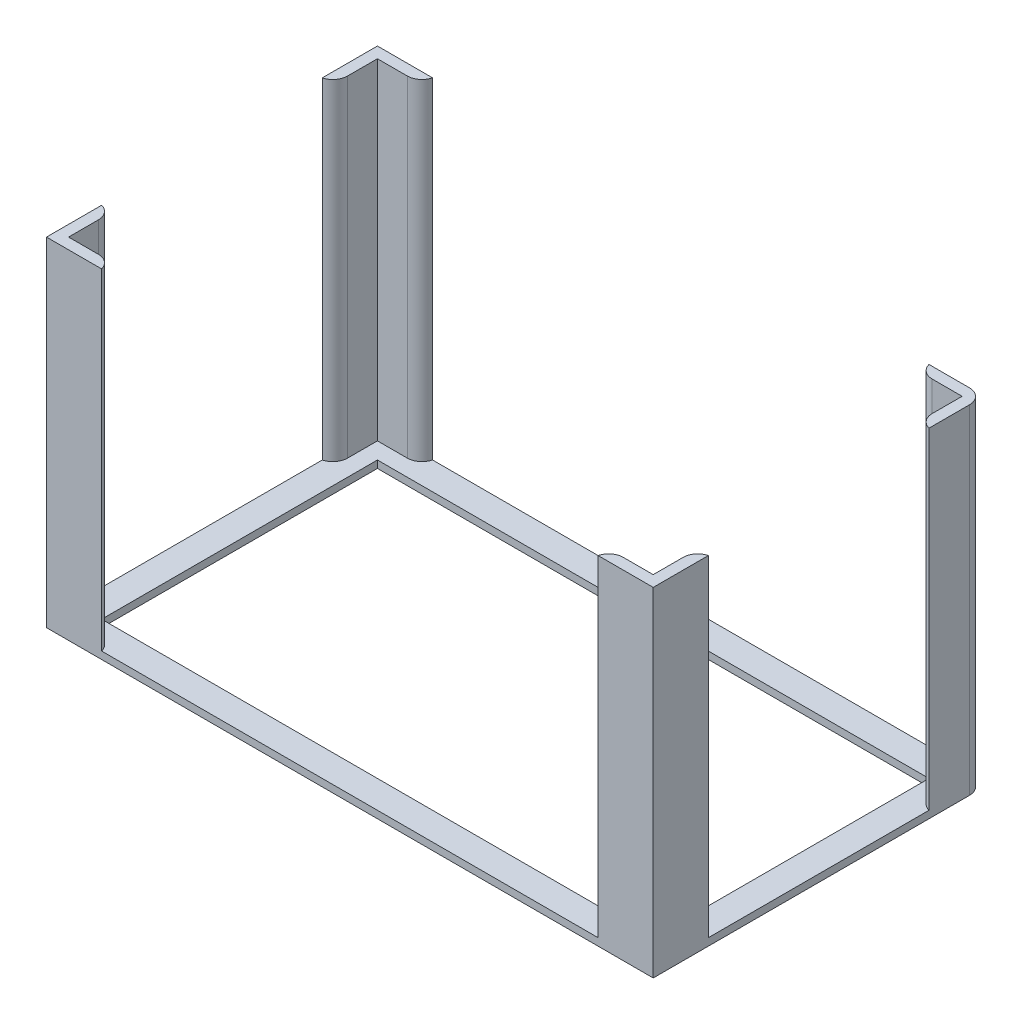
ISO-10303-21;
HEADER;
FILE_DESCRIPTION(('STEP AP214'),'2;1');
FILE_NAME('part.step','',(''),(''),'','','');
FILE_SCHEMA(('AUTOMOTIVE_DESIGN { 1 0 10303 214 1 1 1 1 }'));
ENDSEC;
DATA;
#1=APPLICATION_CONTEXT('core data for automotive mechanical design processes');
#2=APPLICATION_PROTOCOL_DEFINITION('international standard','automotive_design',2000,#1);
#3=PRODUCT_CONTEXT('',#1,'mechanical');
#4=PRODUCT('Part','Part','',(#3));
#5=PRODUCT_RELATED_PRODUCT_CATEGORY('part','',(#4));
#6=PRODUCT_DEFINITION_FORMATION('','',#4);
#7=PRODUCT_DEFINITION_CONTEXT('part definition',#1,'design');
#8=PRODUCT_DEFINITION('design','',#6,#7);
#9=PRODUCT_DEFINITION_SHAPE('','',#8);
#10=(LENGTH_UNIT() NAMED_UNIT(*) SI_UNIT(.MILLI.,.METRE.));
#11=(NAMED_UNIT(*) PLANE_ANGLE_UNIT() SI_UNIT($,.RADIAN.));
#12=(NAMED_UNIT(*) SI_UNIT($,.STERADIAN.) SOLID_ANGLE_UNIT());
#13=UNCERTAINTY_MEASURE_WITH_UNIT(LENGTH_MEASURE(1.E-05),#10,'distance_accuracy_value','');
#14=(GEOMETRIC_REPRESENTATION_CONTEXT(3) GLOBAL_UNCERTAINTY_ASSIGNED_CONTEXT((#13)) GLOBAL_UNIT_ASSIGNED_CONTEXT((#10,
#11,#12)) REPRESENTATION_CONTEXT('',''));
#15=CARTESIAN_POINT('',(0.,0.,0.));
#16=DIRECTION('',(0.,0.,1.));
#17=DIRECTION('',(1.,0.,0.));
#18=AXIS2_PLACEMENT_3D('',#15,#16,#17);
#19=CARTESIAN_POINT('',(0.,2.,0.));
#20=DIRECTION('',(0.,1.,0.));
#21=DIRECTION('',(0.,0.,1.));
#22=AXIS2_PLACEMENT_3D('',#19,#20,#21);
#23=PLANE('',#22);
#24=DIRECTION('',(-1.,0.,0.));
#25=VECTOR('',#24,1.);
#26=CARTESIAN_POINT('',(-75.,2.,-37.5));
#27=LINE('',#26,#25);
#28=CARTESIAN_POINT('',(75.,2.,-37.5));
#29=VERTEX_POINT('',#28);
#30=CARTESIAN_POINT('',(-75.,2.,-37.5));
#31=VERTEX_POINT('',#30);
#32=EDGE_CURVE('E333',#29,#31,#27,.T.);
#33=ORIENTED_EDGE('',*,*,#32,.F.);
#34=DIRECTION('',(0.,0.,-1.));
#35=VECTOR('',#34,1.);
#36=CARTESIAN_POINT('',(75.,2.,-37.5));
#37=LINE('',#36,#35);
#38=CARTESIAN_POINT('',(75.,2.,37.5));
#39=VERTEX_POINT('',#38);
#40=EDGE_CURVE('E331',#39,#29,#37,.T.);
#41=ORIENTED_EDGE('',*,*,#40,.F.);
#42=DIRECTION('',(1.,0.,0.));
#43=VECTOR('',#42,1.);
#44=CARTESIAN_POINT('',(-75.,2.,37.5));
#45=LINE('',#44,#43);
#46=CARTESIAN_POINT('',(-75.,2.,37.5));
#47=VERTEX_POINT('',#46);
#48=EDGE_CURVE('E339',#47,#39,#45,.T.);
#49=ORIENTED_EDGE('',*,*,#48,.F.);
#50=DIRECTION('',(0.,0.,1.));
#51=VECTOR('',#50,1.);
#52=CARTESIAN_POINT('',(-75.,2.,-37.5));
#53=LINE('',#52,#51);
#54=EDGE_CURVE('E336',#31,#47,#53,.T.);
#55=ORIENTED_EDGE('',*,*,#54,.F.);
#56=EDGE_LOOP('',(#33,#41,#49,#55));
#57=FACE_BOUND('',#56,.T.);
#58=DIRECTION('',(-1.,0.,0.));
#59=VECTOR('',#58,1.);
#60=CARTESIAN_POINT('',(-67.5,2.,42.));
#61=LINE('',#60,#59);
#62=CARTESIAN_POINT('',(-71.3729833462074,2.,42.));
#63=VERTEX_POINT('',#62);
#64=CARTESIAN_POINT('',(-79.5,2.,42.));
#65=VERTEX_POINT('',#64);
#66=EDGE_CURVE('E238',#63,#65,#61,.T.);
#67=ORIENTED_EDGE('',*,*,#66,.F.);
#68=CARTESIAN_POINT('',(-71.3729833462074,2.,46.));
#69=DIRECTION('',(0.,1.,0.));
#70=DIRECTION('',(0.,0.,1.));
#71=AXIS2_PLACEMENT_3D('',#68,#69,#70);
#72=CIRCLE('',#71,4.);
#73=CARTESIAN_POINT('',(-67.5,2.,45.));
#74=VERTEX_POINT('',#73);
#75=EDGE_CURVE('E40',#63,#74,#72,.F.);
#76=ORIENTED_EDGE('',*,*,#75,.T.);
#77=DIRECTION('',(1.,0.,0.));
#78=VECTOR('',#77,1.);
#79=CARTESIAN_POINT('',(-82.5,2.,45.));
#80=LINE('',#79,#78);
#81=CARTESIAN_POINT('',(67.5,2.,45.));
#82=VERTEX_POINT('',#81);
#83=EDGE_CURVE('E370',#74,#82,#80,.T.);
#84=ORIENTED_EDGE('',*,*,#83,.T.);
#85=CARTESIAN_POINT('',(71.3729833462074,2.,46.));
#86=DIRECTION('',(0.,1.,0.));
#87=DIRECTION('',(0.,0.,1.));
#88=AXIS2_PLACEMENT_3D('',#85,#86,#87);
#89=CIRCLE('',#88,4.);
#90=CARTESIAN_POINT('',(71.3729833462074,2.,42.));
#91=VERTEX_POINT('',#90);
#92=EDGE_CURVE('E432',#82,#91,#89,.F.);
#93=ORIENTED_EDGE('',*,*,#92,.T.);
#94=DIRECTION('',(1.,0.,0.));
#95=VECTOR('',#94,1.);
#96=CARTESIAN_POINT('',(67.5,2.,42.));
#97=LINE('',#96,#95);
#98=CARTESIAN_POINT('',(79.5,2.,42.));
#99=VERTEX_POINT('',#98);
#100=EDGE_CURVE('E261',#91,#99,#97,.T.);
#101=ORIENTED_EDGE('',*,*,#100,.T.);
#102=DIRECTION('',(0.,0.,-1.));
#103=VECTOR('',#102,1.);
#104=CARTESIAN_POINT('',(79.5,2.,42.));
#105=LINE('',#104,#103);
#106=CARTESIAN_POINT('',(79.5,2.,33.8729833462074));
#107=VERTEX_POINT('',#106);
#108=EDGE_CURVE('E239',#99,#107,#105,.T.);
#109=ORIENTED_EDGE('',*,*,#108,.T.);
#110=CARTESIAN_POINT('',(83.5,2.,33.8729833462074));
#111=DIRECTION('',(0.,1.,0.));
#112=DIRECTION('',(0.,0.,1.));
#113=AXIS2_PLACEMENT_3D('',#110,#111,#112);
#114=CIRCLE('',#113,4.);
#115=CARTESIAN_POINT('',(82.5,2.,30.));
#116=VERTEX_POINT('',#115);
#117=EDGE_CURVE('E434',#107,#116,#114,.F.);
#118=ORIENTED_EDGE('',*,*,#117,.T.);
#119=DIRECTION('',(0.,0.,-1.));
#120=VECTOR('',#119,1.);
#121=CARTESIAN_POINT('',(82.5,2.,-45.));
#122=LINE('',#121,#120);
#123=CARTESIAN_POINT('',(82.5,2.,-30.));
#124=VERTEX_POINT('',#123);
#125=EDGE_CURVE('E362',#116,#124,#122,.T.);
#126=ORIENTED_EDGE('',*,*,#125,.T.);
#127=CARTESIAN_POINT('',(83.5,2.,-33.8729833462074));
#128=DIRECTION('',(0.,1.,0.));
#129=DIRECTION('',(0.,0.,1.));
#130=AXIS2_PLACEMENT_3D('',#127,#128,#129);
#131=CIRCLE('',#130,4.);
#132=CARTESIAN_POINT('',(79.5,2.,-33.8729833462074));
#133=VERTEX_POINT('',#132);
#134=EDGE_CURVE('E408',#124,#133,#131,.F.);
#135=ORIENTED_EDGE('',*,*,#134,.T.);
#136=DIRECTION('',(0.,0.,1.));
#137=VECTOR('',#136,1.);
#138=CARTESIAN_POINT('',(79.5,2.,-42.));
#139=LINE('',#138,#137);
#140=CARTESIAN_POINT('',(79.5,2.,-42.));
#141=VERTEX_POINT('',#140);
#142=EDGE_CURVE('E310',#141,#133,#139,.T.);
#143=ORIENTED_EDGE('',*,*,#142,.F.);
#144=DIRECTION('',(1.,0.,0.));
#145=VECTOR('',#144,1.);
#146=CARTESIAN_POINT('',(67.5,2.,-42.));
#147=LINE('',#146,#145);
#148=CARTESIAN_POINT('',(71.3729833462074,2.,-42.));
#149=VERTEX_POINT('',#148);
#150=EDGE_CURVE('E306',#149,#141,#147,.T.);
#151=ORIENTED_EDGE('',*,*,#150,.F.);
#152=CARTESIAN_POINT('',(71.3729833462074,2.,-46.));
#153=DIRECTION('',(0.,1.,0.));
#154=DIRECTION('',(0.,0.,1.));
#155=AXIS2_PLACEMENT_3D('',#152,#153,#154);
#156=CIRCLE('',#155,4.);
#157=CARTESIAN_POINT('',(67.5,2.,-45.));
#158=VERTEX_POINT('',#157);
#159=EDGE_CURVE('E406',#149,#158,#156,.F.);
#160=ORIENTED_EDGE('',*,*,#159,.T.);
#161=DIRECTION('',(-1.,0.,0.));
#162=VECTOR('',#161,1.);
#163=CARTESIAN_POINT('',(-82.5,2.,-45.));
#164=LINE('',#163,#162);
#165=CARTESIAN_POINT('',(-67.5,2.,-45.));
#166=VERTEX_POINT('',#165);
#167=EDGE_CURVE('E364',#158,#166,#164,.T.);
#168=ORIENTED_EDGE('',*,*,#167,.T.);
#169=CARTESIAN_POINT('',(-71.3729833462074,2.,-46.));
#170=DIRECTION('',(0.,1.,0.));
#171=DIRECTION('',(0.,0.,1.));
#172=AXIS2_PLACEMENT_3D('',#169,#170,#171);
#173=CIRCLE('',#172,4.);
#174=CARTESIAN_POINT('',(-71.3729833462074,2.,-42.));
#175=VERTEX_POINT('',#174);
#176=EDGE_CURVE('E419',#166,#175,#173,.F.);
#177=ORIENTED_EDGE('',*,*,#176,.T.);
#178=DIRECTION('',(-1.,0.,0.));
#179=VECTOR('',#178,1.);
#180=CARTESIAN_POINT('',(-67.5,2.,-42.));
#181=LINE('',#180,#179);
#182=CARTESIAN_POINT('',(-79.5,2.,-42.));
#183=VERTEX_POINT('',#182);
#184=EDGE_CURVE('E286',#175,#183,#181,.T.);
#185=ORIENTED_EDGE('',*,*,#184,.T.);
#186=DIRECTION('',(0.,0.,1.));
#187=VECTOR('',#186,1.);
#188=CARTESIAN_POINT('',(-79.5,2.,-42.));
#189=LINE('',#188,#187);
#190=CARTESIAN_POINT('',(-79.5,2.,-33.8729833462074));
#191=VERTEX_POINT('',#190);
#192=EDGE_CURVE('E281',#183,#191,#189,.T.);
#193=ORIENTED_EDGE('',*,*,#192,.T.);
#194=CARTESIAN_POINT('',(-83.5,2.,-33.8729833462074));
#195=DIRECTION('',(0.,1.,0.));
#196=DIRECTION('',(0.,0.,1.));
#197=AXIS2_PLACEMENT_3D('',#194,#195,#196);
#198=CIRCLE('',#197,4.);
#199=CARTESIAN_POINT('',(-82.5,2.,-30.));
#200=VERTEX_POINT('',#199);
#201=EDGE_CURVE('E421',#191,#200,#198,.F.);
#202=ORIENTED_EDGE('',*,*,#201,.T.);
#203=DIRECTION('',(0.,0.,1.));
#204=VECTOR('',#203,1.);
#205=CARTESIAN_POINT('',(-82.5,2.,-45.));
#206=LINE('',#205,#204);
#207=CARTESIAN_POINT('',(-82.5,2.,30.));
#208=VERTEX_POINT('',#207);
#209=EDGE_CURVE('E368',#200,#208,#206,.T.);
#210=ORIENTED_EDGE('',*,*,#209,.T.);
#211=CARTESIAN_POINT('',(-83.5,2.,33.8729833462074));
#212=DIRECTION('',(0.,1.,0.));
#213=DIRECTION('',(0.,0.,1.));
#214=AXIS2_PLACEMENT_3D('',#211,#212,#213);
#215=CIRCLE('',#214,4.);
#216=CARTESIAN_POINT('',(-79.5,2.,33.8729833462074));
#217=VERTEX_POINT('',#216);
#218=EDGE_CURVE('E11',#208,#217,#215,.F.);
#219=ORIENTED_EDGE('',*,*,#218,.T.);
#220=DIRECTION('',(0.,0.,-1.));
#221=VECTOR('',#220,1.);
#222=CARTESIAN_POINT('',(-79.5,2.,42.));
#223=LINE('',#222,#221);
#224=EDGE_CURVE('E232',#65,#217,#223,.T.);
#225=ORIENTED_EDGE('',*,*,#224,.F.);
#226=EDGE_LOOP('',(#67,#76,#84,#93,#101,#109,#118,#126,#135,#143,#151,#160,#168,#177,#185,#193,
#202,#210,#219,#225));
#227=FACE_BOUND('',#226,.T.);
#228=ADVANCED_FACE('F32',(#57,#227),#23,.T.);
#229=CARTESIAN_POINT('',(0.,0.,0.));
#230=DIRECTION('',(0.,1.,0.));
#231=DIRECTION('',(0.,0.,1.));
#232=AXIS2_PLACEMENT_3D('',#229,#230,#231);
#233=PLANE('',#232);
#234=DIRECTION('',(-1.,0.,0.));
#235=VECTOR('',#234,1.);
#236=CARTESIAN_POINT('',(-82.5,0.,-45.));
#237=LINE('',#236,#235);
#238=CARTESIAN_POINT('',(78.5,0.,-45.));
#239=VERTEX_POINT('',#238);
#240=CARTESIAN_POINT('',(-82.5,0.,-45.));
#241=VERTEX_POINT('',#240);
#242=EDGE_CURVE('E375',#239,#241,#237,.T.);
#243=ORIENTED_EDGE('',*,*,#242,.F.);
#244=CARTESIAN_POINT('',(78.5,0.,-41.));
#245=DIRECTION('',(0.,1.,0.));
#246=DIRECTION('',(0.,0.,1.));
#247=AXIS2_PLACEMENT_3D('',#244,#245,#246);
#248=CIRCLE('',#247,4.);
#249=CARTESIAN_POINT('',(82.5,0.,-41.));
#250=VERTEX_POINT('',#249);
#251=EDGE_CURVE('E391',#239,#250,#248,.F.);
#252=ORIENTED_EDGE('',*,*,#251,.T.);
#253=DIRECTION('',(0.,0.,-1.));
#254=VECTOR('',#253,1.);
#255=CARTESIAN_POINT('',(82.5,0.,-45.));
#256=LINE('',#255,#254);
#257=CARTESIAN_POINT('',(82.5,0.,45.));
#258=VERTEX_POINT('',#257);
#259=EDGE_CURVE('E361',#258,#250,#256,.T.);
#260=ORIENTED_EDGE('',*,*,#259,.F.);
#261=DIRECTION('',(1.,0.,0.));
#262=VECTOR('',#261,1.);
#263=CARTESIAN_POINT('',(-82.5,0.,45.));
#264=LINE('',#263,#262);
#265=CARTESIAN_POINT('',(-82.5,0.,45.));
#266=VERTEX_POINT('',#265);
#267=EDGE_CURVE('E365',#266,#258,#264,.T.);
#268=ORIENTED_EDGE('',*,*,#267,.F.);
#269=DIRECTION('',(0.,0.,1.));
#270=VECTOR('',#269,1.);
#271=CARTESIAN_POINT('',(-82.5,0.,-45.));
#272=LINE('',#271,#270);
#273=EDGE_CURVE('E377',#241,#266,#272,.T.);
#274=ORIENTED_EDGE('',*,*,#273,.F.);
#275=EDGE_LOOP('',(#243,#252,#260,#268,#274));
#276=FACE_BOUND('',#275,.T.);
#277=DIRECTION('',(0.,0.,-1.));
#278=VECTOR('',#277,1.);
#279=CARTESIAN_POINT('',(75.,0.,-37.5));
#280=LINE('',#279,#278);
#281=CARTESIAN_POINT('',(75.,0.,37.5));
#282=VERTEX_POINT('',#281);
#283=CARTESIAN_POINT('',(75.,0.,-37.5));
#284=VERTEX_POINT('',#283);
#285=EDGE_CURVE('E330',#282,#284,#280,.T.);
#286=ORIENTED_EDGE('',*,*,#285,.T.);
#287=DIRECTION('',(-1.,0.,0.));
#288=VECTOR('',#287,1.);
#289=CARTESIAN_POINT('',(-75.,0.,-37.5));
#290=LINE('',#289,#288);
#291=CARTESIAN_POINT('',(-75.,0.,-37.5));
#292=VERTEX_POINT('',#291);
#293=EDGE_CURVE('E344',#284,#292,#290,.T.);
#294=ORIENTED_EDGE('',*,*,#293,.T.);
#295=DIRECTION('',(0.,0.,1.));
#296=VECTOR('',#295,1.);
#297=CARTESIAN_POINT('',(-75.,0.,-37.5));
#298=LINE('',#297,#296);
#299=CARTESIAN_POINT('',(-75.,0.,37.5));
#300=VERTEX_POINT('',#299);
#301=EDGE_CURVE('E347',#292,#300,#298,.T.);
#302=ORIENTED_EDGE('',*,*,#301,.T.);
#303=DIRECTION('',(1.,0.,0.));
#304=VECTOR('',#303,1.);
#305=CARTESIAN_POINT('',(-75.,0.,37.5));
#306=LINE('',#305,#304);
#307=EDGE_CURVE('E334',#300,#282,#306,.T.);
#308=ORIENTED_EDGE('',*,*,#307,.T.);
#309=EDGE_LOOP('',(#286,#294,#302,#308));
#310=FACE_BOUND('',#309,.T.);
#311=ADVANCED_FACE('F459',(#276,#310),#233,.F.);
#312=CARTESIAN_POINT('',(82.5,2.,-45.));
#313=DIRECTION('',(-1.,0.,0.));
#314=DIRECTION('',(0.,0.,1.));
#315=AXIS2_PLACEMENT_3D('',#312,#313,#314);
#316=PLANE('',#315);
#317=ORIENTED_EDGE('',*,*,#259,.T.);
#318=DIRECTION('',(0.,-1.,0.));
#319=VECTOR('',#318,1.);
#320=CARTESIAN_POINT('',(82.5,2.,-41.));
#321=LINE('',#320,#319);
#322=CARTESIAN_POINT('',(82.5,92.,-41.));
#323=VERTEX_POINT('',#322);
#324=EDGE_CURVE('E393',#250,#323,#321,.F.);
#325=ORIENTED_EDGE('',*,*,#324,.T.);
#326=DIRECTION('',(0.,0.,-1.));
#327=VECTOR('',#326,1.);
#328=CARTESIAN_POINT('',(82.5,92.,-30.));
#329=LINE('',#328,#327);
#330=CARTESIAN_POINT('',(82.5,92.,-30.));
#331=VERTEX_POINT('',#330);
#332=EDGE_CURVE('E313',#331,#323,#329,.T.);
#333=ORIENTED_EDGE('',*,*,#332,.F.);
#334=DIRECTION('',(0.,-1.,0.));
#335=VECTOR('',#334,1.);
#336=CARTESIAN_POINT('',(82.5,92.,-30.));
#337=LINE('',#336,#335);
#338=EDGE_CURVE('E324',#331,#124,#337,.T.);
#339=ORIENTED_EDGE('',*,*,#338,.T.);
#340=ORIENTED_EDGE('',*,*,#125,.F.);
#341=DIRECTION('',(0.,-1.,0.));
#342=VECTOR('',#341,1.);
#343=CARTESIAN_POINT('',(82.5,92.,30.));
#344=LINE('',#343,#342);
#345=CARTESIAN_POINT('',(82.5,92.,30.));
#346=VERTEX_POINT('',#345);
#347=EDGE_CURVE('E275',#346,#116,#344,.T.);
#348=ORIENTED_EDGE('',*,*,#347,.F.);
#349=DIRECTION('',(0.,0.,1.));
#350=VECTOR('',#349,1.);
#351=CARTESIAN_POINT('',(82.5,92.,30.));
#352=LINE('',#351,#350);
#353=CARTESIAN_POINT('',(82.5,92.,45.));
#354=VERTEX_POINT('',#353);
#355=EDGE_CURVE('E260',#346,#354,#352,.T.);
#356=ORIENTED_EDGE('',*,*,#355,.T.);
#357=DIRECTION('',(0.,-1.,0.));
#358=VECTOR('',#357,1.);
#359=CARTESIAN_POINT('',(82.5,2.,45.));
#360=LINE('',#359,#358);
#361=EDGE_CURVE('E372',#354,#258,#360,.T.);
#362=ORIENTED_EDGE('',*,*,#361,.T.);
#363=EDGE_LOOP('',(#317,#325,#333,#339,#340,#348,#356,#362));
#364=FACE_BOUND('',#363,.T.);
#365=ADVANCED_FACE('F465',(#364),#316,.F.);
#366=CARTESIAN_POINT('',(-82.5,2.,-45.));
#367=DIRECTION('',(0.,0.,1.));
#368=DIRECTION('',(1.,0.,0.));
#369=AXIS2_PLACEMENT_3D('',#366,#367,#368);
#370=PLANE('',#369);
#371=DIRECTION('',(-1.,0.,0.));
#372=VECTOR('',#371,1.);
#373=CARTESIAN_POINT('',(82.5,92.,-45.));
#374=LINE('',#373,#372);
#375=CARTESIAN_POINT('',(78.5,92.,-45.));
#376=VERTEX_POINT('',#375);
#377=CARTESIAN_POINT('',(67.5,92.,-45.));
#378=VERTEX_POINT('',#377);
#379=EDGE_CURVE('E316',#376,#378,#374,.T.);
#380=ORIENTED_EDGE('',*,*,#379,.F.);
#381=DIRECTION('',(0.,-1.,0.));
#382=VECTOR('',#381,1.);
#383=CARTESIAN_POINT('',(78.5,2.,-45.));
#384=LINE('',#383,#382);
#385=EDGE_CURVE('E388',#376,#239,#384,.T.);
#386=ORIENTED_EDGE('',*,*,#385,.T.);
#387=ORIENTED_EDGE('',*,*,#242,.T.);
#388=DIRECTION('',(0.,-1.,0.));
#389=VECTOR('',#388,1.);
#390=CARTESIAN_POINT('',(-82.5,2.,-45.));
#391=LINE('',#390,#389);
#392=CARTESIAN_POINT('',(-82.5,92.,-45.));
#393=VERTEX_POINT('',#392);
#394=EDGE_CURVE('E385',#393,#241,#391,.T.);
#395=ORIENTED_EDGE('',*,*,#394,.F.);
#396=DIRECTION('',(1.,0.,0.));
#397=VECTOR('',#396,1.);
#398=CARTESIAN_POINT('',(-82.5,92.,-45.));
#399=LINE('',#398,#397);
#400=CARTESIAN_POINT('',(-67.5,92.,-45.));
#401=VERTEX_POINT('',#400);
#402=EDGE_CURVE('E282',#393,#401,#399,.T.);
#403=ORIENTED_EDGE('',*,*,#402,.T.);
#404=DIRECTION('',(0.,-1.,0.));
#405=VECTOR('',#404,1.);
#406=CARTESIAN_POINT('',(-67.5,92.,-45.));
#407=LINE('',#406,#405);
#408=EDGE_CURVE('E303',#401,#166,#407,.T.);
#409=ORIENTED_EDGE('',*,*,#408,.T.);
#410=ORIENTED_EDGE('',*,*,#167,.F.);
#411=DIRECTION('',(0.,-1.,0.));
#412=VECTOR('',#411,1.);
#413=CARTESIAN_POINT('',(67.5,92.,-45.));
#414=LINE('',#413,#412);
#415=EDGE_CURVE('E318',#378,#158,#414,.T.);
#416=ORIENTED_EDGE('',*,*,#415,.F.);
#417=EDGE_LOOP('',(#380,#386,#387,#395,#403,#409,#410,#416));
#418=FACE_BOUND('',#417,.T.);
#419=ADVANCED_FACE('F478',(#418),#370,.F.);
#420=CARTESIAN_POINT('',(-82.5,2.,-45.));
#421=DIRECTION('',(1.,0.,0.));
#422=DIRECTION('',(0.,0.,-1.));
#423=AXIS2_PLACEMENT_3D('',#420,#421,#422);
#424=PLANE('',#423);
#425=ORIENTED_EDGE('',*,*,#273,.T.);
#426=DIRECTION('',(0.,-1.,0.));
#427=VECTOR('',#426,1.);
#428=CARTESIAN_POINT('',(-82.5,2.,45.));
#429=LINE('',#428,#427);
#430=CARTESIAN_POINT('',(-82.5,92.,45.));
#431=VERTEX_POINT('',#430);
#432=EDGE_CURVE('E382',#431,#266,#429,.T.);
#433=ORIENTED_EDGE('',*,*,#432,.F.);
#434=DIRECTION('',(0.,0.,1.));
#435=VECTOR('',#434,1.);
#436=CARTESIAN_POINT('',(-82.5,92.,30.));
#437=LINE('',#436,#435);
#438=CARTESIAN_POINT('',(-82.5,92.,30.));
#439=VERTEX_POINT('',#438);
#440=EDGE_CURVE('E243',#439,#431,#437,.T.);
#441=ORIENTED_EDGE('',*,*,#440,.F.);
#442=DIRECTION('',(0.,-1.,0.));
#443=VECTOR('',#442,1.);
#444=CARTESIAN_POINT('',(-82.5,92.,30.));
#445=LINE('',#444,#443);
#446=EDGE_CURVE('E240',#439,#208,#445,.T.);
#447=ORIENTED_EDGE('',*,*,#446,.T.);
#448=ORIENTED_EDGE('',*,*,#209,.F.);
#449=DIRECTION('',(0.,-1.,0.));
#450=VECTOR('',#449,1.);
#451=CARTESIAN_POINT('',(-82.5,92.,-30.));
#452=LINE('',#451,#450);
#453=CARTESIAN_POINT('',(-82.5,92.,-30.));
#454=VERTEX_POINT('',#453);
#455=EDGE_CURVE('E300',#454,#200,#452,.T.);
#456=ORIENTED_EDGE('',*,*,#455,.F.);
#457=DIRECTION('',(0.,0.,-1.));
#458=VECTOR('',#457,1.);
#459=CARTESIAN_POINT('',(-82.5,92.,-30.));
#460=LINE('',#459,#458);
#461=EDGE_CURVE('E285',#454,#393,#460,.T.);
#462=ORIENTED_EDGE('',*,*,#461,.T.);
#463=ORIENTED_EDGE('',*,*,#394,.T.);
#464=EDGE_LOOP('',(#425,#433,#441,#447,#448,#456,#462,#463));
#465=FACE_BOUND('',#464,.T.);
#466=ADVANCED_FACE('F475',(#465),#424,.F.);
#467=CARTESIAN_POINT('',(-82.5,2.,45.));
#468=DIRECTION('',(0.,0.,-1.));
#469=DIRECTION('',(-1.,0.,0.));
#470=AXIS2_PLACEMENT_3D('',#467,#468,#469);
#471=PLANE('',#470);
#472=ORIENTED_EDGE('',*,*,#267,.T.);
#473=ORIENTED_EDGE('',*,*,#361,.F.);
#474=DIRECTION('',(-1.,0.,0.));
#475=VECTOR('',#474,1.);
#476=CARTESIAN_POINT('',(82.5,92.,45.));
#477=LINE('',#476,#475);
#478=CARTESIAN_POINT('',(67.5,92.,45.));
#479=VERTEX_POINT('',#478);
#480=EDGE_CURVE('E257',#354,#479,#477,.T.);
#481=ORIENTED_EDGE('',*,*,#480,.T.);
#482=DIRECTION('',(0.,-1.,0.));
#483=VECTOR('',#482,1.);
#484=CARTESIAN_POINT('',(67.5,92.,45.));
#485=LINE('',#484,#483);
#486=EDGE_CURVE('E278',#479,#82,#485,.T.);
#487=ORIENTED_EDGE('',*,*,#486,.T.);
#488=ORIENTED_EDGE('',*,*,#83,.F.);
#489=DIRECTION('',(0.,-1.,0.));
#490=VECTOR('',#489,1.);
#491=CARTESIAN_POINT('',(-67.5,92.,45.));
#492=LINE('',#491,#490);
#493=CARTESIAN_POINT('',(-67.5,92.,45.));
#494=VERTEX_POINT('',#493);
#495=EDGE_CURVE('E250',#494,#74,#492,.T.);
#496=ORIENTED_EDGE('',*,*,#495,.F.);
#497=DIRECTION('',(1.,0.,0.));
#498=VECTOR('',#497,1.);
#499=CARTESIAN_POINT('',(-82.5,92.,45.));
#500=LINE('',#499,#498);
#501=EDGE_CURVE('E246',#431,#494,#500,.T.);
#502=ORIENTED_EDGE('',*,*,#501,.F.);
#503=ORIENTED_EDGE('',*,*,#432,.T.);
#504=EDGE_LOOP('',(#472,#473,#481,#487,#488,#496,#502,#503));
#505=FACE_BOUND('',#504,.T.);
#506=ADVANCED_FACE('F446',(#505),#471,.F.);
#507=CARTESIAN_POINT('',(75.,2.,-37.5));
#508=DIRECTION('',(-1.,0.,0.));
#509=DIRECTION('',(0.,0.,1.));
#510=AXIS2_PLACEMENT_3D('',#507,#508,#509);
#511=PLANE('',#510);
#512=ORIENTED_EDGE('',*,*,#285,.F.);
#513=DIRECTION('',(0.,-1.,0.));
#514=VECTOR('',#513,1.);
#515=CARTESIAN_POINT('',(75.,2.,37.5));
#516=LINE('',#515,#514);
#517=EDGE_CURVE('E341',#39,#282,#516,.T.);
#518=ORIENTED_EDGE('',*,*,#517,.F.);
#519=ORIENTED_EDGE('',*,*,#40,.T.);
#520=DIRECTION('',(0.,-1.,0.));
#521=VECTOR('',#520,1.);
#522=CARTESIAN_POINT('',(75.,2.,-37.5));
#523=LINE('',#522,#521);
#524=EDGE_CURVE('E358',#29,#284,#523,.T.);
#525=ORIENTED_EDGE('',*,*,#524,.T.);
#526=EDGE_LOOP('',(#512,#518,#519,#525));
#527=FACE_BOUND('',#526,.T.);
#528=ADVANCED_FACE('F470',(#527),#511,.T.);
#529=CARTESIAN_POINT('',(-75.,2.,-37.5));
#530=DIRECTION('',(0.,0.,1.));
#531=DIRECTION('',(1.,0.,0.));
#532=AXIS2_PLACEMENT_3D('',#529,#530,#531);
#533=PLANE('',#532);
#534=ORIENTED_EDGE('',*,*,#293,.F.);
#535=ORIENTED_EDGE('',*,*,#524,.F.);
#536=ORIENTED_EDGE('',*,*,#32,.T.);
#537=DIRECTION('',(0.,-1.,0.));
#538=VECTOR('',#537,1.);
#539=CARTESIAN_POINT('',(-75.,2.,-37.5));
#540=LINE('',#539,#538);
#541=EDGE_CURVE('E356',#31,#292,#540,.T.);
#542=ORIENTED_EDGE('',*,*,#541,.T.);
#543=EDGE_LOOP('',(#534,#535,#536,#542));
#544=FACE_BOUND('',#543,.T.);
#545=ADVANCED_FACE('F604',(#544),#533,.T.);
#546=CARTESIAN_POINT('',(-75.,2.,-37.5));
#547=DIRECTION('',(1.,0.,0.));
#548=DIRECTION('',(0.,0.,-1.));
#549=AXIS2_PLACEMENT_3D('',#546,#547,#548);
#550=PLANE('',#549);
#551=ORIENTED_EDGE('',*,*,#301,.F.);
#552=ORIENTED_EDGE('',*,*,#541,.F.);
#553=ORIENTED_EDGE('',*,*,#54,.T.);
#554=DIRECTION('',(0.,-1.,0.));
#555=VECTOR('',#554,1.);
#556=CARTESIAN_POINT('',(-75.,2.,37.5));
#557=LINE('',#556,#555);
#558=EDGE_CURVE('E354',#47,#300,#557,.T.);
#559=ORIENTED_EDGE('',*,*,#558,.T.);
#560=EDGE_LOOP('',(#551,#552,#553,#559));
#561=FACE_BOUND('',#560,.T.);
#562=ADVANCED_FACE('F601',(#561),#550,.T.);
#563=CARTESIAN_POINT('',(-75.,2.,37.5));
#564=DIRECTION('',(0.,0.,-1.));
#565=DIRECTION('',(-1.,0.,0.));
#566=AXIS2_PLACEMENT_3D('',#563,#564,#565);
#567=PLANE('',#566);
#568=ORIENTED_EDGE('',*,*,#307,.F.);
#569=ORIENTED_EDGE('',*,*,#558,.F.);
#570=ORIENTED_EDGE('',*,*,#48,.T.);
#571=ORIENTED_EDGE('',*,*,#517,.T.);
#572=EDGE_LOOP('',(#568,#569,#570,#571));
#573=FACE_BOUND('',#572,.T.);
#574=ADVANCED_FACE('F598',(#573),#567,.T.);
#575=CARTESIAN_POINT('',(67.5,92.,-42.));
#576=DIRECTION('',(0.,0.,-1.));
#577=DIRECTION('',(-1.,0.,0.));
#578=AXIS2_PLACEMENT_3D('',#575,#576,#577);
#579=PLANE('',#578);
#580=DIRECTION('',(1.,0.,0.));
#581=VECTOR('',#580,1.);
#582=CARTESIAN_POINT('',(67.5,92.,-42.));
#583=LINE('',#582,#581);
#584=CARTESIAN_POINT('',(71.3729833462074,92.,-42.));
#585=VERTEX_POINT('',#584);
#586=CARTESIAN_POINT('',(79.5,92.,-42.));
#587=VERTEX_POINT('',#586);
#588=EDGE_CURVE('E307',#585,#587,#583,.T.);
#589=ORIENTED_EDGE('',*,*,#588,.F.);
#590=DIRECTION('',(0.,-1.,0.));
#591=VECTOR('',#590,1.);
#592=CARTESIAN_POINT('',(71.3729833462074,92.,-42.));
#593=LINE('',#592,#591);
#594=EDGE_CURVE('E401',#585,#149,#593,.T.);
#595=ORIENTED_EDGE('',*,*,#594,.T.);
#596=ORIENTED_EDGE('',*,*,#150,.T.);
#597=DIRECTION('',(0.,-1.,0.));
#598=VECTOR('',#597,1.);
#599=CARTESIAN_POINT('',(79.5,92.,-42.));
#600=LINE('',#599,#598);
#601=EDGE_CURVE('E327',#587,#141,#600,.T.);
#602=ORIENTED_EDGE('',*,*,#601,.F.);
#603=EDGE_LOOP('',(#589,#595,#596,#602));
#604=FACE_BOUND('',#603,.T.);
#605=ADVANCED_FACE('F550',(#604),#579,.F.);
#606=CARTESIAN_POINT('',(79.5,92.,-42.));
#607=DIRECTION('',(1.,0.,0.));
#608=DIRECTION('',(0.,0.,-1.));
#609=AXIS2_PLACEMENT_3D('',#606,#607,#608);
#610=PLANE('',#609);
#611=ORIENTED_EDGE('',*,*,#142,.T.);
#612=DIRECTION('',(0.,1.,0.));
#613=VECTOR('',#612,1.);
#614=CARTESIAN_POINT('',(79.5,92.,-33.8729833462074));
#615=LINE('',#614,#613);
#616=CARTESIAN_POINT('',(79.5,92.,-33.8729833462074));
#617=VERTEX_POINT('',#616);
#618=EDGE_CURVE('E404',#133,#617,#615,.T.);
#619=ORIENTED_EDGE('',*,*,#618,.T.);
#620=DIRECTION('',(0.,0.,1.));
#621=VECTOR('',#620,1.);
#622=CARTESIAN_POINT('',(79.5,92.,-42.));
#623=LINE('',#622,#621);
#624=EDGE_CURVE('E309',#587,#617,#623,.T.);
#625=ORIENTED_EDGE('',*,*,#624,.F.);
#626=ORIENTED_EDGE('',*,*,#601,.T.);
#627=EDGE_LOOP('',(#611,#619,#625,#626));
#628=FACE_BOUND('',#627,.T.);
#629=ADVANCED_FACE('F545',(#628),#610,.F.);
#630=CARTESIAN_POINT('',(0.,92.,0.));
#631=DIRECTION('',(0.,1.,0.));
#632=DIRECTION('',(0.,0.,1.));
#633=AXIS2_PLACEMENT_3D('',#630,#631,#632);
#634=PLANE('',#633);
#635=ORIENTED_EDGE('',*,*,#332,.T.);
#636=CARTESIAN_POINT('',(78.5,92.,-41.));
#637=DIRECTION('',(0.,1.,0.));
#638=DIRECTION('',(0.,0.,1.));
#639=AXIS2_PLACEMENT_3D('',#636,#637,#638);
#640=CIRCLE('',#639,4.);
#641=EDGE_CURVE('E399',#323,#376,#640,.T.);
#642=ORIENTED_EDGE('',*,*,#641,.T.);
#643=ORIENTED_EDGE('',*,*,#379,.T.);
#644=CARTESIAN_POINT('',(71.3729833462074,92.,-46.));
#645=DIRECTION('',(0.,1.,0.));
#646=DIRECTION('',(0.,0.,1.));
#647=AXIS2_PLACEMENT_3D('',#644,#645,#646);
#648=CIRCLE('',#647,4.);
#649=EDGE_CURVE('E397',#378,#585,#648,.T.);
#650=ORIENTED_EDGE('',*,*,#649,.T.);
#651=ORIENTED_EDGE('',*,*,#588,.T.);
#652=ORIENTED_EDGE('',*,*,#624,.T.);
#653=CARTESIAN_POINT('',(83.5,92.,-33.8729833462074));
#654=DIRECTION('',(0.,1.,0.));
#655=DIRECTION('',(0.,0.,1.));
#656=AXIS2_PLACEMENT_3D('',#653,#654,#655);
#657=CIRCLE('',#656,4.);
#658=EDGE_CURVE('E395',#617,#331,#657,.T.);
#659=ORIENTED_EDGE('',*,*,#658,.T.);
#660=EDGE_LOOP('',(#635,#642,#643,#650,#651,#652,#659));
#661=FACE_BOUND('',#660,.T.);
#662=ADVANCED_FACE('F490',(#661),#634,.T.);
#663=CARTESIAN_POINT('',(78.5,2.,-41.));
#664=DIRECTION('',(0.,-1.,0.));
#665=DIRECTION('',(0.,0.,-1.));
#666=AXIS2_PLACEMENT_3D('',#663,#664,#665);
#667=CYLINDRICAL_SURFACE('',#666,4.);
#668=ORIENTED_EDGE('',*,*,#641,.F.);
#669=ORIENTED_EDGE('',*,*,#324,.F.);
#670=ORIENTED_EDGE('',*,*,#251,.F.);
#671=ORIENTED_EDGE('',*,*,#385,.F.);
#672=EDGE_LOOP('',(#668,#669,#670,#671));
#673=FACE_BOUND('',#672,.T.);
#674=ADVANCED_FACE('F486',(#673),#667,.T.);
#675=CARTESIAN_POINT('',(71.3729833462074,92.,-46.));
#676=DIRECTION('',(0.,-1.,0.));
#677=DIRECTION('',(0.,0.,-1.));
#678=AXIS2_PLACEMENT_3D('',#675,#676,#677);
#679=CYLINDRICAL_SURFACE('',#678,4.);
#680=ORIENTED_EDGE('',*,*,#649,.F.);
#681=ORIENTED_EDGE('',*,*,#415,.T.);
#682=ORIENTED_EDGE('',*,*,#159,.F.);
#683=ORIENTED_EDGE('',*,*,#594,.F.);
#684=EDGE_LOOP('',(#680,#681,#682,#683));
#685=FACE_BOUND('',#684,.T.);
#686=ADVANCED_FACE('F489',(#685),#679,.T.);
#687=CARTESIAN_POINT('',(83.5,92.,-33.8729833462074));
#688=DIRECTION('',(0.,1.,0.));
#689=DIRECTION('',(0.,0.,1.));
#690=AXIS2_PLACEMENT_3D('',#687,#688,#689);
#691=CYLINDRICAL_SURFACE('',#690,4.);
#692=ORIENTED_EDGE('',*,*,#658,.F.);
#693=ORIENTED_EDGE('',*,*,#618,.F.);
#694=ORIENTED_EDGE('',*,*,#134,.F.);
#695=ORIENTED_EDGE('',*,*,#338,.F.);
#696=EDGE_LOOP('',(#692,#693,#694,#695));
#697=FACE_BOUND('',#696,.T.);
#698=ADVANCED_FACE('F494',(#697),#691,.T.);
#699=CARTESIAN_POINT('',(-79.5,92.,-42.));
#700=DIRECTION('',(1.,0.,0.));
#701=DIRECTION('',(0.,0.,-1.));
#702=AXIS2_PLACEMENT_3D('',#699,#700,#701);
#703=PLANE('',#702);
#704=DIRECTION('',(0.,0.,1.));
#705=VECTOR('',#704,1.);
#706=CARTESIAN_POINT('',(-79.5,92.,-42.));
#707=LINE('',#706,#705);
#708=CARTESIAN_POINT('',(-79.5,92.,-42.));
#709=VERTEX_POINT('',#708);
#710=CARTESIAN_POINT('',(-79.5,92.,-33.8729833462074));
#711=VERTEX_POINT('',#710);
#712=EDGE_CURVE('E289',#709,#711,#707,.T.);
#713=ORIENTED_EDGE('',*,*,#712,.T.);
#714=DIRECTION('',(0.,-1.,0.));
#715=VECTOR('',#714,1.);
#716=CARTESIAN_POINT('',(-79.5,2.,-33.8729833462074));
#717=LINE('',#716,#715);
#718=EDGE_CURVE('E416',#711,#191,#717,.T.);
#719=ORIENTED_EDGE('',*,*,#718,.T.);
#720=ORIENTED_EDGE('',*,*,#192,.F.);
#721=DIRECTION('',(0.,-1.,0.));
#722=VECTOR('',#721,1.);
#723=CARTESIAN_POINT('',(-79.5,92.,-42.));
#724=LINE('',#723,#722);
#725=EDGE_CURVE('E294',#709,#183,#724,.T.);
#726=ORIENTED_EDGE('',*,*,#725,.F.);
#727=EDGE_LOOP('',(#713,#719,#720,#726));
#728=FACE_BOUND('',#727,.T.);
#729=ADVANCED_FACE('F498',(#728),#703,.T.);
#730=CARTESIAN_POINT('',(-67.5,92.,-42.));
#731=DIRECTION('',(0.,0.,1.));
#732=DIRECTION('',(1.,0.,0.));
#733=AXIS2_PLACEMENT_3D('',#730,#731,#732);
#734=PLANE('',#733);
#735=ORIENTED_EDGE('',*,*,#184,.F.);
#736=DIRECTION('',(0.,1.,0.));
#737=VECTOR('',#736,1.);
#738=CARTESIAN_POINT('',(-71.3729833462074,92.,-42.));
#739=LINE('',#738,#737);
#740=CARTESIAN_POINT('',(-71.3729833462074,92.,-42.));
#741=VERTEX_POINT('',#740);
#742=EDGE_CURVE('E410',#175,#741,#739,.T.);
#743=ORIENTED_EDGE('',*,*,#742,.T.);
#744=DIRECTION('',(-1.,0.,0.));
#745=VECTOR('',#744,1.);
#746=CARTESIAN_POINT('',(-67.5,92.,-42.));
#747=LINE('',#746,#745);
#748=EDGE_CURVE('E292',#741,#709,#747,.T.);
#749=ORIENTED_EDGE('',*,*,#748,.T.);
#750=ORIENTED_EDGE('',*,*,#725,.T.);
#751=EDGE_LOOP('',(#735,#743,#749,#750));
#752=FACE_BOUND('',#751,.T.);
#753=ADVANCED_FACE('F577',(#752),#734,.T.);
#754=CARTESIAN_POINT('',(0.,92.,0.));
#755=DIRECTION('',(0.,1.,0.));
#756=DIRECTION('',(0.,0.,1.));
#757=AXIS2_PLACEMENT_3D('',#754,#755,#756);
#758=PLANE('',#757);
#759=ORIENTED_EDGE('',*,*,#748,.F.);
#760=CARTESIAN_POINT('',(-71.3729833462074,92.,-46.));
#761=DIRECTION('',(0.,1.,0.));
#762=DIRECTION('',(0.,0.,1.));
#763=AXIS2_PLACEMENT_3D('',#760,#761,#762);
#764=CIRCLE('',#763,4.);
#765=EDGE_CURVE('E414',#741,#401,#764,.T.);
#766=ORIENTED_EDGE('',*,*,#765,.T.);
#767=ORIENTED_EDGE('',*,*,#402,.F.);
#768=ORIENTED_EDGE('',*,*,#461,.F.);
#769=CARTESIAN_POINT('',(-83.5,92.,-33.8729833462074));
#770=DIRECTION('',(0.,1.,0.));
#771=DIRECTION('',(0.,0.,1.));
#772=AXIS2_PLACEMENT_3D('',#769,#770,#771);
#773=CIRCLE('',#772,4.);
#774=EDGE_CURVE('E412',#454,#711,#773,.T.);
#775=ORIENTED_EDGE('',*,*,#774,.T.);
#776=ORIENTED_EDGE('',*,*,#712,.F.);
#777=EDGE_LOOP('',(#759,#766,#767,#768,#775,#776));
#778=FACE_BOUND('',#777,.T.);
#779=ADVANCED_FACE('F504',(#778),#758,.T.);
#780=CARTESIAN_POINT('',(-71.3729833462074,92.,-46.));
#781=DIRECTION('',(0.,-1.,0.));
#782=DIRECTION('',(0.,0.,-1.));
#783=AXIS2_PLACEMENT_3D('',#780,#781,#782);
#784=CYLINDRICAL_SURFACE('',#783,4.);
#785=ORIENTED_EDGE('',*,*,#765,.F.);
#786=ORIENTED_EDGE('',*,*,#742,.F.);
#787=ORIENTED_EDGE('',*,*,#176,.F.);
#788=ORIENTED_EDGE('',*,*,#408,.F.);
#789=EDGE_LOOP('',(#785,#786,#787,#788));
#790=FACE_BOUND('',#789,.T.);
#791=ADVANCED_FACE('F500',(#790),#784,.T.);
#792=CARTESIAN_POINT('',(-83.5,92.,-33.8729833462074));
#793=DIRECTION('',(0.,1.,0.));
#794=DIRECTION('',(0.,0.,1.));
#795=AXIS2_PLACEMENT_3D('',#792,#793,#794);
#796=CYLINDRICAL_SURFACE('',#795,4.);
#797=ORIENTED_EDGE('',*,*,#774,.F.);
#798=ORIENTED_EDGE('',*,*,#455,.T.);
#799=ORIENTED_EDGE('',*,*,#201,.F.);
#800=ORIENTED_EDGE('',*,*,#718,.F.);
#801=EDGE_LOOP('',(#797,#798,#799,#800));
#802=FACE_BOUND('',#801,.T.);
#803=ADVANCED_FACE('F503',(#802),#796,.T.);
#804=CARTESIAN_POINT('',(79.5,92.,42.));
#805=DIRECTION('',(-1.,0.,0.));
#806=DIRECTION('',(0.,0.,1.));
#807=AXIS2_PLACEMENT_3D('',#804,#805,#806);
#808=PLANE('',#807);
#809=DIRECTION('',(0.,0.,-1.));
#810=VECTOR('',#809,1.);
#811=CARTESIAN_POINT('',(79.5,92.,42.));
#812=LINE('',#811,#810);
#813=CARTESIAN_POINT('',(79.5,92.,42.));
#814=VERTEX_POINT('',#813);
#815=CARTESIAN_POINT('',(79.5,92.,33.8729833462074));
#816=VERTEX_POINT('',#815);
#817=EDGE_CURVE('E264',#814,#816,#812,.T.);
#818=ORIENTED_EDGE('',*,*,#817,.T.);
#819=DIRECTION('',(0.,-1.,0.));
#820=VECTOR('',#819,1.);
#821=CARTESIAN_POINT('',(79.5,2.,33.8729833462074));
#822=LINE('',#821,#820);
#823=EDGE_CURVE('E429',#816,#107,#822,.T.);
#824=ORIENTED_EDGE('',*,*,#823,.T.);
#825=ORIENTED_EDGE('',*,*,#108,.F.);
#826=DIRECTION('',(0.,-1.,0.));
#827=VECTOR('',#826,1.);
#828=CARTESIAN_POINT('',(79.5,92.,42.));
#829=LINE('',#828,#827);
#830=EDGE_CURVE('E269',#814,#99,#829,.T.);
#831=ORIENTED_EDGE('',*,*,#830,.F.);
#832=EDGE_LOOP('',(#818,#824,#825,#831));
#833=FACE_BOUND('',#832,.T.);
#834=ADVANCED_FACE('F508',(#833),#808,.T.);
#835=CARTESIAN_POINT('',(67.5,92.,42.));
#836=DIRECTION('',(0.,0.,-1.));
#837=DIRECTION('',(-1.,0.,0.));
#838=AXIS2_PLACEMENT_3D('',#835,#836,#837);
#839=PLANE('',#838);
#840=ORIENTED_EDGE('',*,*,#100,.F.);
#841=DIRECTION('',(0.,1.,0.));
#842=VECTOR('',#841,1.);
#843=CARTESIAN_POINT('',(71.3729833462074,92.,42.));
#844=LINE('',#843,#842);
#845=CARTESIAN_POINT('',(71.3729833462074,92.,42.));
#846=VERTEX_POINT('',#845);
#847=EDGE_CURVE('E423',#91,#846,#844,.T.);
#848=ORIENTED_EDGE('',*,*,#847,.T.);
#849=DIRECTION('',(1.,0.,0.));
#850=VECTOR('',#849,1.);
#851=CARTESIAN_POINT('',(67.5,92.,42.));
#852=LINE('',#851,#850);
#853=EDGE_CURVE('E267',#846,#814,#852,.T.);
#854=ORIENTED_EDGE('',*,*,#853,.T.);
#855=ORIENTED_EDGE('',*,*,#830,.T.);
#856=EDGE_LOOP('',(#840,#848,#854,#855));
#857=FACE_BOUND('',#856,.T.);
#858=ADVANCED_FACE('F533',(#857),#839,.T.);
#859=CARTESIAN_POINT('',(0.,92.,0.));
#860=DIRECTION('',(0.,1.,0.));
#861=DIRECTION('',(0.,0.,-1.));
#862=AXIS2_PLACEMENT_3D('',#859,#860,#861);
#863=PLANE('',#862);
#864=ORIENTED_EDGE('',*,*,#853,.F.);
#865=CARTESIAN_POINT('',(71.3729833462074,92.,46.));
#866=DIRECTION('',(0.,1.,0.));
#867=DIRECTION('',(0.,0.,1.));
#868=AXIS2_PLACEMENT_3D('',#865,#866,#867);
#869=CIRCLE('',#868,4.);
#870=EDGE_CURVE('E427',#846,#479,#869,.T.);
#871=ORIENTED_EDGE('',*,*,#870,.T.);
#872=ORIENTED_EDGE('',*,*,#480,.F.);
#873=ORIENTED_EDGE('',*,*,#355,.F.);
#874=CARTESIAN_POINT('',(83.5,92.,33.8729833462074));
#875=DIRECTION('',(0.,1.,0.));
#876=DIRECTION('',(0.,0.,1.));
#877=AXIS2_PLACEMENT_3D('',#874,#875,#876);
#878=CIRCLE('',#877,4.);
#879=EDGE_CURVE('E425',#346,#816,#878,.T.);
#880=ORIENTED_EDGE('',*,*,#879,.T.);
#881=ORIENTED_EDGE('',*,*,#817,.F.);
#882=EDGE_LOOP('',(#864,#871,#872,#873,#880,#881));
#883=FACE_BOUND('',#882,.T.);
#884=ADVANCED_FACE('F513',(#883),#863,.T.);
#885=CARTESIAN_POINT('',(71.3729833462074,92.,46.));
#886=DIRECTION('',(0.,-1.,0.));
#887=DIRECTION('',(0.,0.,-1.));
#888=AXIS2_PLACEMENT_3D('',#885,#886,#887);
#889=CYLINDRICAL_SURFACE('',#888,4.);
#890=ORIENTED_EDGE('',*,*,#870,.F.);
#891=ORIENTED_EDGE('',*,*,#847,.F.);
#892=ORIENTED_EDGE('',*,*,#92,.F.);
#893=ORIENTED_EDGE('',*,*,#486,.F.);
#894=EDGE_LOOP('',(#890,#891,#892,#893));
#895=FACE_BOUND('',#894,.T.);
#896=ADVANCED_FACE('F510',(#895),#889,.T.);
#897=CARTESIAN_POINT('',(83.5,92.,33.8729833462074));
#898=DIRECTION('',(0.,1.,0.));
#899=DIRECTION('',(0.,0.,1.));
#900=AXIS2_PLACEMENT_3D('',#897,#898,#899);
#901=CYLINDRICAL_SURFACE('',#900,4.);
#902=ORIENTED_EDGE('',*,*,#879,.F.);
#903=ORIENTED_EDGE('',*,*,#347,.T.);
#904=ORIENTED_EDGE('',*,*,#117,.F.);
#905=ORIENTED_EDGE('',*,*,#823,.F.);
#906=EDGE_LOOP('',(#902,#903,#904,#905));
#907=FACE_BOUND('',#906,.T.);
#908=ADVANCED_FACE('F512',(#907),#901,.T.);
#909=CARTESIAN_POINT('',(-67.5,92.,42.));
#910=DIRECTION('',(0.,0.,1.));
#911=DIRECTION('',(1.,0.,0.));
#912=AXIS2_PLACEMENT_3D('',#909,#910,#911);
#913=PLANE('',#912);
#914=DIRECTION('',(-1.,0.,0.));
#915=VECTOR('',#914,1.);
#916=CARTESIAN_POINT('',(-67.5,92.,42.));
#917=LINE('',#916,#915);
#918=CARTESIAN_POINT('',(-71.3729833462074,92.,42.));
#919=VERTEX_POINT('',#918);
#920=CARTESIAN_POINT('',(-79.5,92.,42.));
#921=VERTEX_POINT('',#920);
#922=EDGE_CURVE('E222',#919,#921,#917,.T.);
#923=ORIENTED_EDGE('',*,*,#922,.F.);
#924=DIRECTION('',(0.,-1.,0.));
#925=VECTOR('',#924,1.);
#926=CARTESIAN_POINT('',(-71.3729833462074,92.,42.));
#927=LINE('',#926,#925);
#928=EDGE_CURVE('E436',#919,#63,#927,.T.);
#929=ORIENTED_EDGE('',*,*,#928,.T.);
#930=ORIENTED_EDGE('',*,*,#66,.T.);
#931=DIRECTION('',(0.,-1.,0.));
#932=VECTOR('',#931,1.);
#933=CARTESIAN_POINT('',(-79.5,92.,42.));
#934=LINE('',#933,#932);
#935=EDGE_CURVE('E235',#921,#65,#934,.T.);
#936=ORIENTED_EDGE('',*,*,#935,.F.);
#937=EDGE_LOOP('',(#923,#929,#930,#936));
#938=FACE_BOUND('',#937,.T.);
#939=ADVANCED_FACE('F236',(#938),#913,.F.);
#940=CARTESIAN_POINT('',(-79.5,92.,42.));
#941=DIRECTION('',(-1.,0.,0.));
#942=DIRECTION('',(0.,0.,1.));
#943=AXIS2_PLACEMENT_3D('',#940,#941,#942);
#944=PLANE('',#943);
#945=ORIENTED_EDGE('',*,*,#224,.T.);
#946=DIRECTION('',(0.,1.,0.));
#947=VECTOR('',#946,1.);
#948=CARTESIAN_POINT('',(-79.5,92.,33.8729833462074));
#949=LINE('',#948,#947);
#950=CARTESIAN_POINT('',(-79.5,92.,33.8729833462074));
#951=VERTEX_POINT('',#950);
#952=EDGE_CURVE('E52',#217,#951,#949,.T.);
#953=ORIENTED_EDGE('',*,*,#952,.T.);
#954=DIRECTION('',(0.,0.,-1.));
#955=VECTOR('',#954,1.);
#956=CARTESIAN_POINT('',(-79.5,92.,42.));
#957=LINE('',#956,#955);
#958=EDGE_CURVE('E225',#921,#951,#957,.T.);
#959=ORIENTED_EDGE('',*,*,#958,.F.);
#960=ORIENTED_EDGE('',*,*,#935,.T.);
#961=EDGE_LOOP('',(#945,#953,#959,#960));
#962=FACE_BOUND('',#961,.T.);
#963=ADVANCED_FACE('F242',(#962),#944,.F.);
#964=CARTESIAN_POINT('',(0.,92.,0.));
#965=DIRECTION('',(0.,1.,0.));
#966=DIRECTION('',(0.,0.,-1.));
#967=AXIS2_PLACEMENT_3D('',#964,#965,#966);
#968=PLANE('',#967);
#969=ORIENTED_EDGE('',*,*,#501,.T.);
#970=CARTESIAN_POINT('',(-71.3729833462074,92.,46.));
#971=DIRECTION('',(0.,1.,0.));
#972=DIRECTION('',(0.,0.,1.));
#973=AXIS2_PLACEMENT_3D('',#970,#971,#972);
#974=CIRCLE('',#973,4.);
#975=EDGE_CURVE('E228',#494,#919,#974,.T.);
#976=ORIENTED_EDGE('',*,*,#975,.T.);
#977=ORIENTED_EDGE('',*,*,#922,.T.);
#978=ORIENTED_EDGE('',*,*,#958,.T.);
#979=CARTESIAN_POINT('',(-83.5,92.,33.8729833462074));
#980=DIRECTION('',(0.,1.,0.));
#981=DIRECTION('',(0.,0.,1.));
#982=AXIS2_PLACEMENT_3D('',#979,#980,#981);
#983=CIRCLE('',#982,4.);
#984=EDGE_CURVE('E438',#951,#439,#983,.T.);
#985=ORIENTED_EDGE('',*,*,#984,.T.);
#986=ORIENTED_EDGE('',*,*,#440,.T.);
#987=EDGE_LOOP('',(#969,#976,#977,#978,#985,#986));
#988=FACE_BOUND('',#987,.T.);
#989=ADVANCED_FACE('F224',(#988),#968,.T.);
#990=CARTESIAN_POINT('',(-71.3729833462074,92.,46.));
#991=DIRECTION('',(0.,-1.,0.));
#992=DIRECTION('',(0.,0.,-1.));
#993=AXIS2_PLACEMENT_3D('',#990,#991,#992);
#994=CYLINDRICAL_SURFACE('',#993,4.);
#995=ORIENTED_EDGE('',*,*,#975,.F.);
#996=ORIENTED_EDGE('',*,*,#495,.T.);
#997=ORIENTED_EDGE('',*,*,#75,.F.);
#998=ORIENTED_EDGE('',*,*,#928,.F.);
#999=EDGE_LOOP('',(#995,#996,#997,#998));
#1000=FACE_BOUND('',#999,.T.);
#1001=ADVANCED_FACE('F449',(#1000),#994,.T.);
#1002=CARTESIAN_POINT('',(-83.5,92.,33.8729833462074));
#1003=DIRECTION('',(0.,1.,0.));
#1004=DIRECTION('',(0.,0.,1.));
#1005=AXIS2_PLACEMENT_3D('',#1002,#1003,#1004);
#1006=CYLINDRICAL_SURFACE('',#1005,4.);
#1007=ORIENTED_EDGE('',*,*,#984,.F.);
#1008=ORIENTED_EDGE('',*,*,#952,.F.);
#1009=ORIENTED_EDGE('',*,*,#218,.F.);
#1010=ORIENTED_EDGE('',*,*,#446,.F.);
#1011=EDGE_LOOP('',(#1007,#1008,#1009,#1010));
#1012=FACE_BOUND('',#1011,.T.);
#1013=ADVANCED_FACE('F34',(#1012),#1006,.T.);
#1014=CLOSED_SHELL('',(#228,#311,#365,#419,#466,#506,#528,#545,#562,#574,#605,#629,#662,#674,
#686,#698,#729,#753,#779,#791,#803,#834,#858,#884,#896,#908,#939,#963,#989,#1001,#1013));
#1015=MANIFOLD_SOLID_BREP('B2',#1014);
#1016=ADVANCED_BREP_SHAPE_REPRESENTATION('',(#18,#1015),#14);
#1017=SHAPE_DEFINITION_REPRESENTATION(#9,#1016);
ENDSEC;
END-ISO-10303-21;
